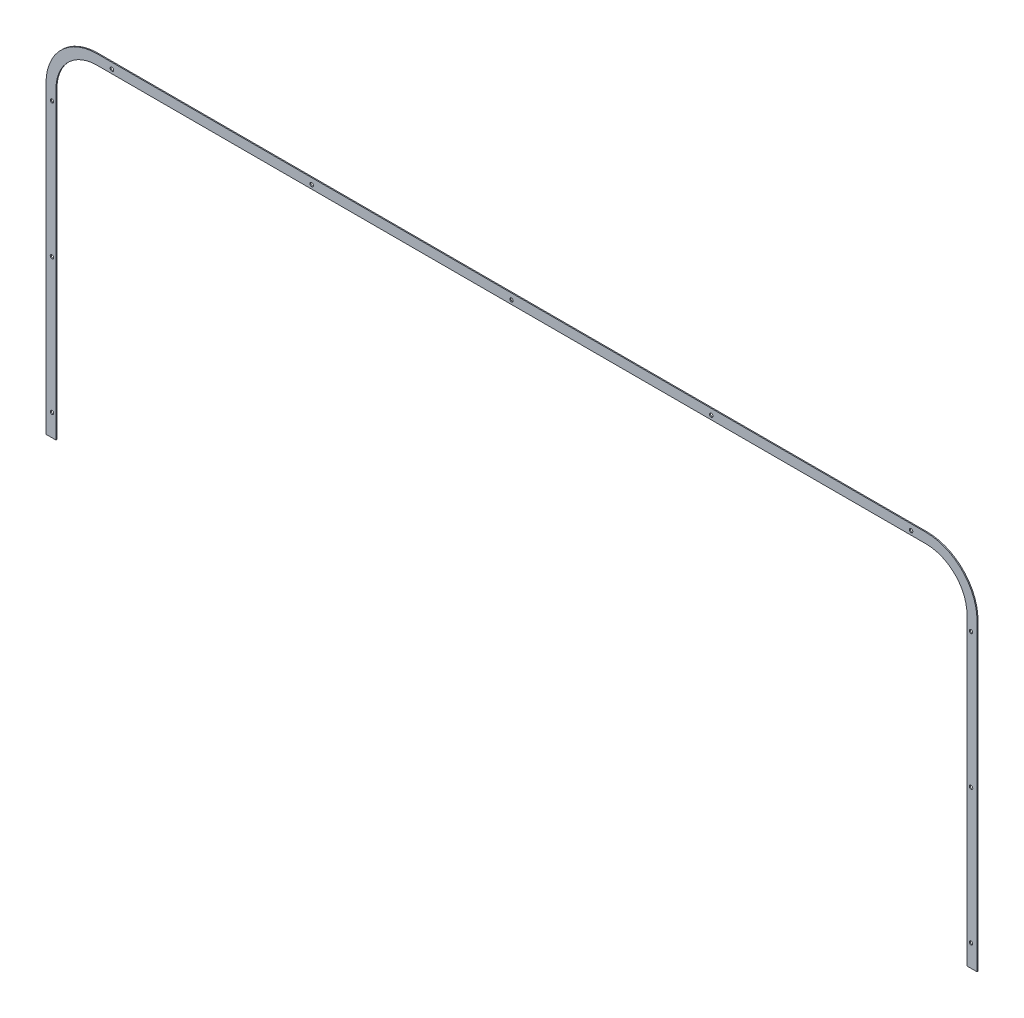
ISO-10303-21;
HEADER;
FILE_DESCRIPTION(('STEP AP214'),'2;1');
FILE_NAME('part.step','',(''),(''),'','','');
FILE_SCHEMA(('AUTOMOTIVE_DESIGN { 1 0 10303 214 1 1 1 1 }'));
ENDSEC;
DATA;
#1=APPLICATION_CONTEXT('core data for automotive mechanical design processes');
#2=APPLICATION_PROTOCOL_DEFINITION('international standard','automotive_design',2000,#1);
#3=PRODUCT_CONTEXT('',#1,'mechanical');
#4=PRODUCT('Part','Part','',(#3));
#5=PRODUCT_RELATED_PRODUCT_CATEGORY('part','',(#4));
#6=PRODUCT_DEFINITION_FORMATION('','',#4);
#7=PRODUCT_DEFINITION_CONTEXT('part definition',#1,'design');
#8=PRODUCT_DEFINITION('design','',#6,#7);
#9=PRODUCT_DEFINITION_SHAPE('','',#8);
#10=(LENGTH_UNIT() NAMED_UNIT(*) SI_UNIT(.MILLI.,.METRE.));
#11=(NAMED_UNIT(*) PLANE_ANGLE_UNIT() SI_UNIT($,.RADIAN.));
#12=(NAMED_UNIT(*) SI_UNIT($,.STERADIAN.) SOLID_ANGLE_UNIT());
#13=UNCERTAINTY_MEASURE_WITH_UNIT(LENGTH_MEASURE(1.E-05),#10,'distance_accuracy_value','');
#14=(GEOMETRIC_REPRESENTATION_CONTEXT(3) GLOBAL_UNCERTAINTY_ASSIGNED_CONTEXT((#13)) GLOBAL_UNIT_ASSIGNED_CONTEXT((#10,
#11,#12)) REPRESENTATION_CONTEXT('',''));
#15=CARTESIAN_POINT('',(0.,0.,0.));
#16=DIRECTION('',(0.,0.,1.));
#17=DIRECTION('',(1.,0.,0.));
#18=AXIS2_PLACEMENT_3D('',#15,#16,#17);
#19=CARTESIAN_POINT('',(932.,579.999999999999,-66.));
#20=DIRECTION('',(1.,0.,0.));
#21=DIRECTION('',(0.,0.,1.));
#22=AXIS2_PLACEMENT_3D('',#19,#20,#21);
#23=PLANE('',#22);
#24=DIRECTION('',(0.,-1.,0.));
#25=VECTOR('',#24,1.);
#26=CARTESIAN_POINT('',(932.,579.999999999999,-64.));
#27=LINE('',#26,#25);
#28=CARTESIAN_POINT('',(932.,579.999999999999,-64.));
#29=VERTEX_POINT('',#28);
#30=CARTESIAN_POINT('',(932.,-29.0000000000002,-64.));
#31=VERTEX_POINT('',#30);
#32=EDGE_CURVE('E153',#29,#31,#27,.T.);
#33=ORIENTED_EDGE('',*,*,#32,.T.);
#34=DIRECTION('',(0.,0.,1.));
#35=VECTOR('',#34,1.);
#36=CARTESIAN_POINT('',(932.,-29.0000000000002,-66.));
#37=LINE('',#36,#35);
#38=CARTESIAN_POINT('',(932.,-29.0000000000002,-66.));
#39=VERTEX_POINT('',#38);
#40=EDGE_CURVE('E149',#39,#31,#37,.T.);
#41=ORIENTED_EDGE('',*,*,#40,.F.);
#42=DIRECTION('',(0.,-1.,0.));
#43=VECTOR('',#42,1.);
#44=CARTESIAN_POINT('',(932.,579.999999999999,-66.));
#45=LINE('',#44,#43);
#46=CARTESIAN_POINT('',(932.,579.999999999999,-66.));
#47=VERTEX_POINT('',#46);
#48=EDGE_CURVE('E181',#47,#39,#45,.T.);
#49=ORIENTED_EDGE('',*,*,#48,.F.);
#50=DIRECTION('',(0.,0.,1.));
#51=VECTOR('',#50,1.);
#52=CARTESIAN_POINT('',(932.,579.999999999999,-66.));
#53=LINE('',#52,#51);
#54=EDGE_CURVE('E11',#47,#29,#53,.T.);
#55=ORIENTED_EDGE('',*,*,#54,.T.);
#56=EDGE_LOOP('',(#33,#41,#49,#55));
#57=FACE_BOUND('',#56,.T.);
#58=ADVANCED_FACE('F32',(#57),#23,.T.);
#59=CARTESIAN_POINT('',(830.,580.,-66.));
#60=DIRECTION('',(0.,0.,1.));
#61=DIRECTION('',(-1.,0.,0.));
#62=AXIS2_PLACEMENT_3D('',#59,#60,#61);
#63=CYLINDRICAL_SURFACE('',#62,102.);
#64=CARTESIAN_POINT('',(830.,580.,-64.));
#65=DIRECTION('',(0.,0.,-1.));
#66=DIRECTION('',(-1.,0.,0.));
#67=AXIS2_PLACEMENT_3D('',#64,#65,#66);
#68=CIRCLE('',#67,102.);
#69=CARTESIAN_POINT('',(829.999999999999,682.,-64.));
#70=VERTEX_POINT('',#69);
#71=EDGE_CURVE('E97',#70,#29,#68,.T.);
#72=ORIENTED_EDGE('',*,*,#71,.T.);
#73=ORIENTED_EDGE('',*,*,#54,.F.);
#74=CARTESIAN_POINT('',(830.,580.,-66.));
#75=DIRECTION('',(0.,0.,-1.));
#76=DIRECTION('',(-1.,0.,0.));
#77=AXIS2_PLACEMENT_3D('',#74,#75,#76);
#78=CIRCLE('',#77,102.);
#79=CARTESIAN_POINT('',(829.999999999999,682.,-66.));
#80=VERTEX_POINT('',#79);
#81=EDGE_CURVE('E50',#80,#47,#78,.T.);
#82=ORIENTED_EDGE('',*,*,#81,.F.);
#83=DIRECTION('',(0.,0.,1.));
#84=VECTOR('',#83,1.);
#85=CARTESIAN_POINT('',(829.999999999999,682.,-66.));
#86=LINE('',#85,#84);
#87=EDGE_CURVE('E41',#80,#70,#86,.T.);
#88=ORIENTED_EDGE('',*,*,#87,.T.);
#89=EDGE_LOOP('',(#72,#73,#82,#88));
#90=FACE_BOUND('',#89,.T.);
#91=ADVANCED_FACE('F308',(#90),#63,.T.);
#92=CARTESIAN_POINT('',(-829.999999999999,682.,-66.));
#93=DIRECTION('',(0.,1.,0.));
#94=DIRECTION('',(0.,0.,-1.));
#95=AXIS2_PLACEMENT_3D('',#92,#93,#94);
#96=PLANE('',#95);
#97=DIRECTION('',(1.,0.,0.));
#98=VECTOR('',#97,1.);
#99=CARTESIAN_POINT('',(-829.999999999999,682.,-64.));
#100=LINE('',#99,#98);
#101=CARTESIAN_POINT('',(-829.999999999999,682.,-64.));
#102=VERTEX_POINT('',#101);
#103=EDGE_CURVE('E91',#102,#70,#100,.T.);
#104=ORIENTED_EDGE('',*,*,#103,.T.);
#105=ORIENTED_EDGE('',*,*,#87,.F.);
#106=DIRECTION('',(1.,0.,0.));
#107=VECTOR('',#106,1.);
#108=CARTESIAN_POINT('',(-829.999999999999,682.,-66.));
#109=LINE('',#108,#107);
#110=CARTESIAN_POINT('',(-829.999999999999,682.,-66.));
#111=VERTEX_POINT('',#110);
#112=EDGE_CURVE('E134',#111,#80,#109,.T.);
#113=ORIENTED_EDGE('',*,*,#112,.F.);
#114=DIRECTION('',(0.,0.,1.));
#115=VECTOR('',#114,1.);
#116=CARTESIAN_POINT('',(-829.999999999999,682.,-66.));
#117=LINE('',#116,#115);
#118=EDGE_CURVE('E141',#111,#102,#117,.T.);
#119=ORIENTED_EDGE('',*,*,#118,.T.);
#120=EDGE_LOOP('',(#104,#105,#113,#119));
#121=FACE_BOUND('',#120,.T.);
#122=ADVANCED_FACE('F147',(#121),#96,.T.);
#123=CARTESIAN_POINT('',(-830.,580.,-66.));
#124=DIRECTION('',(0.,0.,1.));
#125=DIRECTION('',(-1.,0.,0.));
#126=AXIS2_PLACEMENT_3D('',#123,#124,#125);
#127=CYLINDRICAL_SURFACE('',#126,102.);
#128=CARTESIAN_POINT('',(-830.,580.,-64.));
#129=DIRECTION('',(0.,0.,-1.));
#130=DIRECTION('',(-1.,0.,0.));
#131=AXIS2_PLACEMENT_3D('',#128,#129,#130);
#132=CIRCLE('',#131,102.);
#133=CARTESIAN_POINT('',(-932.,579.999999999999,-64.));
#134=VERTEX_POINT('',#133);
#135=EDGE_CURVE('E144',#134,#102,#132,.T.);
#136=ORIENTED_EDGE('',*,*,#135,.T.);
#137=ORIENTED_EDGE('',*,*,#118,.F.);
#138=CARTESIAN_POINT('',(-830.,580.,-66.));
#139=DIRECTION('',(0.,0.,-1.));
#140=DIRECTION('',(-1.,0.,0.));
#141=AXIS2_PLACEMENT_3D('',#138,#139,#140);
#142=CIRCLE('',#141,102.);
#143=CARTESIAN_POINT('',(-932.,579.999999999999,-66.));
#144=VERTEX_POINT('',#143);
#145=EDGE_CURVE('E130',#144,#111,#142,.T.);
#146=ORIENTED_EDGE('',*,*,#145,.F.);
#147=DIRECTION('',(0.,0.,1.));
#148=VECTOR('',#147,1.);
#149=CARTESIAN_POINT('',(-932.,579.999999999999,-66.));
#150=LINE('',#149,#148);
#151=EDGE_CURVE('E145',#144,#134,#150,.T.);
#152=ORIENTED_EDGE('',*,*,#151,.T.);
#153=EDGE_LOOP('',(#136,#137,#146,#152));
#154=FACE_BOUND('',#153,.T.);
#155=ADVANCED_FACE('F142',(#154),#127,.T.);
#156=CARTESIAN_POINT('',(-932.,-29.0000000000002,-66.));
#157=DIRECTION('',(-1.,0.,0.));
#158=DIRECTION('',(0.,0.,-1.));
#159=AXIS2_PLACEMENT_3D('',#156,#157,#158);
#160=PLANE('',#159);
#161=DIRECTION('',(0.,1.,0.));
#162=VECTOR('',#161,1.);
#163=CARTESIAN_POINT('',(-932.,-29.0000000000002,-64.));
#164=LINE('',#163,#162);
#165=CARTESIAN_POINT('',(-932.,-29.0000000000002,-64.));
#166=VERTEX_POINT('',#165);
#167=EDGE_CURVE('E177',#166,#134,#164,.T.);
#168=ORIENTED_EDGE('',*,*,#167,.T.);
#169=ORIENTED_EDGE('',*,*,#151,.F.);
#170=DIRECTION('',(0.,1.,0.));
#171=VECTOR('',#170,1.);
#172=CARTESIAN_POINT('',(-932.,-29.0000000000002,-66.));
#173=LINE('',#172,#171);
#174=CARTESIAN_POINT('',(-932.,-29.0000000000002,-66.));
#175=VERTEX_POINT('',#174);
#176=EDGE_CURVE('E136',#175,#144,#173,.T.);
#177=ORIENTED_EDGE('',*,*,#176,.F.);
#178=DIRECTION('',(0.,0.,1.));
#179=VECTOR('',#178,1.);
#180=CARTESIAN_POINT('',(-932.,-29.0000000000002,-66.));
#181=LINE('',#180,#179);
#182=EDGE_CURVE('E185',#175,#166,#181,.T.);
#183=ORIENTED_EDGE('',*,*,#182,.T.);
#184=EDGE_LOOP('',(#168,#169,#177,#183));
#185=FACE_BOUND('',#184,.T.);
#186=ADVANCED_FACE('F304',(#185),#160,.T.);
#187=CARTESIAN_POINT('',(-932.,-29.0000000000002,-66.));
#188=DIRECTION('',(0.,1.,0.));
#189=DIRECTION('',(0.,0.,-1.));
#190=AXIS2_PLACEMENT_3D('',#187,#188,#189);
#191=PLANE('',#190);
#192=DIRECTION('',(1.,0.,0.));
#193=VECTOR('',#192,1.);
#194=CARTESIAN_POINT('',(-932.,-29.0000000000002,-64.));
#195=LINE('',#194,#193);
#196=CARTESIAN_POINT('',(-912.,-29.0000000000002,-64.));
#197=VERTEX_POINT('',#196);
#198=EDGE_CURVE('E174',#166,#197,#195,.T.);
#199=ORIENTED_EDGE('',*,*,#198,.F.);
#200=ORIENTED_EDGE('',*,*,#182,.F.);
#201=DIRECTION('',(1.,0.,0.));
#202=VECTOR('',#201,1.);
#203=CARTESIAN_POINT('',(-932.,-29.0000000000002,-66.));
#204=LINE('',#203,#202);
#205=CARTESIAN_POINT('',(-912.,-29.0000000000002,-66.));
#206=VERTEX_POINT('',#205);
#207=EDGE_CURVE('E290',#175,#206,#204,.T.);
#208=ORIENTED_EDGE('',*,*,#207,.T.);
#209=DIRECTION('',(0.,0.,1.));
#210=VECTOR('',#209,1.);
#211=CARTESIAN_POINT('',(-912.,-29.0000000000002,-66.));
#212=LINE('',#211,#210);
#213=EDGE_CURVE('E188',#206,#197,#212,.T.);
#214=ORIENTED_EDGE('',*,*,#213,.T.);
#215=EDGE_LOOP('',(#199,#200,#208,#214));
#216=FACE_BOUND('',#215,.T.);
#217=ADVANCED_FACE('F294',(#216),#191,.F.);
#218=CARTESIAN_POINT('',(-912.,-29.0000000000002,-66.));
#219=DIRECTION('',(-1.,0.,0.));
#220=DIRECTION('',(0.,0.,-1.));
#221=AXIS2_PLACEMENT_3D('',#218,#219,#220);
#222=PLANE('',#221);
#223=DIRECTION('',(0.,1.,0.));
#224=VECTOR('',#223,1.);
#225=CARTESIAN_POINT('',(-912.,-29.0000000000002,-64.));
#226=LINE('',#225,#224);
#227=CARTESIAN_POINT('',(-912.,579.999999999999,-64.));
#228=VERTEX_POINT('',#227);
#229=EDGE_CURVE('E171',#197,#228,#226,.T.);
#230=ORIENTED_EDGE('',*,*,#229,.F.);
#231=ORIENTED_EDGE('',*,*,#213,.F.);
#232=DIRECTION('',(0.,1.,0.));
#233=VECTOR('',#232,1.);
#234=CARTESIAN_POINT('',(-912.,-29.0000000000002,-66.));
#235=LINE('',#234,#233);
#236=CARTESIAN_POINT('',(-912.,579.999999999999,-66.));
#237=VERTEX_POINT('',#236);
#238=EDGE_CURVE('E287',#206,#237,#235,.T.);
#239=ORIENTED_EDGE('',*,*,#238,.T.);
#240=DIRECTION('',(0.,0.,1.));
#241=VECTOR('',#240,1.);
#242=CARTESIAN_POINT('',(-912.,579.999999999999,-66.));
#243=LINE('',#242,#241);
#244=EDGE_CURVE('E191',#237,#228,#243,.T.);
#245=ORIENTED_EDGE('',*,*,#244,.T.);
#246=EDGE_LOOP('',(#230,#231,#239,#245));
#247=FACE_BOUND('',#246,.T.);
#248=ADVANCED_FACE('F298',(#247),#222,.F.);
#249=CARTESIAN_POINT('',(-830.,580.,-66.));
#250=DIRECTION('',(0.,0.,1.));
#251=DIRECTION('',(-1.,0.,0.));
#252=AXIS2_PLACEMENT_3D('',#249,#250,#251);
#253=CYLINDRICAL_SURFACE('',#252,82.);
#254=CARTESIAN_POINT('',(-830.,580.,-64.));
#255=DIRECTION('',(0.,0.,-1.));
#256=DIRECTION('',(-1.,0.,0.));
#257=AXIS2_PLACEMENT_3D('',#254,#255,#256);
#258=CIRCLE('',#257,82.);
#259=CARTESIAN_POINT('',(-829.999999999999,662.,-64.));
#260=VERTEX_POINT('',#259);
#261=EDGE_CURVE('E168',#228,#260,#258,.T.);
#262=ORIENTED_EDGE('',*,*,#261,.F.);
#263=ORIENTED_EDGE('',*,*,#244,.F.);
#264=CARTESIAN_POINT('',(-830.,580.,-66.));
#265=DIRECTION('',(0.,0.,-1.));
#266=DIRECTION('',(-1.,0.,0.));
#267=AXIS2_PLACEMENT_3D('',#264,#265,#266);
#268=CIRCLE('',#267,82.);
#269=CARTESIAN_POINT('',(-829.999999999999,662.,-66.));
#270=VERTEX_POINT('',#269);
#271=EDGE_CURVE('E284',#237,#270,#268,.T.);
#272=ORIENTED_EDGE('',*,*,#271,.T.);
#273=DIRECTION('',(0.,0.,1.));
#274=VECTOR('',#273,1.);
#275=CARTESIAN_POINT('',(-829.999999999999,662.,-66.));
#276=LINE('',#275,#274);
#277=EDGE_CURVE('E194',#270,#260,#276,.T.);
#278=ORIENTED_EDGE('',*,*,#277,.T.);
#279=EDGE_LOOP('',(#262,#263,#272,#278));
#280=FACE_BOUND('',#279,.T.);
#281=ADVANCED_FACE('F327',(#280),#253,.F.);
#282=CARTESIAN_POINT('',(-829.999999999999,662.,-66.));
#283=DIRECTION('',(0.,1.,0.));
#284=DIRECTION('',(0.,0.,-1.));
#285=AXIS2_PLACEMENT_3D('',#282,#283,#284);
#286=PLANE('',#285);
#287=DIRECTION('',(-1.,0.,0.));
#288=VECTOR('',#287,1.);
#289=CARTESIAN_POINT('',(-829.999999999999,662.,-64.));
#290=LINE('',#289,#288);
#291=CARTESIAN_POINT('',(829.999999999999,662.,-64.));
#292=VERTEX_POINT('',#291);
#293=EDGE_CURVE('E165',#260,#292,#290,.F.);
#294=ORIENTED_EDGE('',*,*,#293,.F.);
#295=ORIENTED_EDGE('',*,*,#277,.F.);
#296=DIRECTION('',(-1.,0.,0.));
#297=VECTOR('',#296,1.);
#298=CARTESIAN_POINT('',(-829.999999999999,662.,-66.));
#299=LINE('',#298,#297);
#300=CARTESIAN_POINT('',(829.999999999999,662.,-66.));
#301=VERTEX_POINT('',#300);
#302=EDGE_CURVE('E281',#270,#301,#299,.F.);
#303=ORIENTED_EDGE('',*,*,#302,.T.);
#304=DIRECTION('',(0.,0.,1.));
#305=VECTOR('',#304,1.);
#306=CARTESIAN_POINT('',(829.999999999999,662.,-66.));
#307=LINE('',#306,#305);
#308=EDGE_CURVE('E197',#301,#292,#307,.T.);
#309=ORIENTED_EDGE('',*,*,#308,.T.);
#310=EDGE_LOOP('',(#294,#295,#303,#309));
#311=FACE_BOUND('',#310,.T.);
#312=ADVANCED_FACE('F330',(#311),#286,.F.);
#313=CARTESIAN_POINT('',(830.,580.,-66.));
#314=DIRECTION('',(0.,0.,1.));
#315=DIRECTION('',(-1.,0.,0.));
#316=AXIS2_PLACEMENT_3D('',#313,#314,#315);
#317=CYLINDRICAL_SURFACE('',#316,82.);
#318=CARTESIAN_POINT('',(830.,580.,-64.));
#319=DIRECTION('',(0.,0.,-1.));
#320=DIRECTION('',(-1.,0.,0.));
#321=AXIS2_PLACEMENT_3D('',#318,#319,#320);
#322=CIRCLE('',#321,82.);
#323=CARTESIAN_POINT('',(912.,579.999999999999,-64.));
#324=VERTEX_POINT('',#323);
#325=EDGE_CURVE('E162',#292,#324,#322,.T.);
#326=ORIENTED_EDGE('',*,*,#325,.F.);
#327=ORIENTED_EDGE('',*,*,#308,.F.);
#328=CARTESIAN_POINT('',(830.,580.,-66.));
#329=DIRECTION('',(0.,0.,-1.));
#330=DIRECTION('',(-1.,0.,0.));
#331=AXIS2_PLACEMENT_3D('',#328,#329,#330);
#332=CIRCLE('',#331,82.);
#333=CARTESIAN_POINT('',(912.,579.999999999999,-66.));
#334=VERTEX_POINT('',#333);
#335=EDGE_CURVE('E278',#301,#334,#332,.T.);
#336=ORIENTED_EDGE('',*,*,#335,.T.);
#337=DIRECTION('',(0.,0.,1.));
#338=VECTOR('',#337,1.);
#339=CARTESIAN_POINT('',(912.,579.999999999999,-66.));
#340=LINE('',#339,#338);
#341=EDGE_CURVE('E200',#334,#324,#340,.T.);
#342=ORIENTED_EDGE('',*,*,#341,.T.);
#343=EDGE_LOOP('',(#326,#327,#336,#342));
#344=FACE_BOUND('',#343,.T.);
#345=ADVANCED_FACE('F334',(#344),#317,.F.);
#346=CARTESIAN_POINT('',(912.,579.999999999999,-66.));
#347=DIRECTION('',(1.,0.,0.));
#348=DIRECTION('',(0.,0.,1.));
#349=AXIS2_PLACEMENT_3D('',#346,#347,#348);
#350=PLANE('',#349);
#351=DIRECTION('',(0.,1.,0.));
#352=VECTOR('',#351,1.);
#353=CARTESIAN_POINT('',(912.,579.999999999999,-64.));
#354=LINE('',#353,#352);
#355=CARTESIAN_POINT('',(912.,-29.0000000000002,-64.));
#356=VERTEX_POINT('',#355);
#357=EDGE_CURVE('E159',#324,#356,#354,.F.);
#358=ORIENTED_EDGE('',*,*,#357,.F.);
#359=ORIENTED_EDGE('',*,*,#341,.F.);
#360=DIRECTION('',(0.,1.,0.));
#361=VECTOR('',#360,1.);
#362=CARTESIAN_POINT('',(912.,579.999999999999,-66.));
#363=LINE('',#362,#361);
#364=CARTESIAN_POINT('',(912.,-29.0000000000002,-66.));
#365=VERTEX_POINT('',#364);
#366=EDGE_CURVE('E275',#334,#365,#363,.F.);
#367=ORIENTED_EDGE('',*,*,#366,.T.);
#368=DIRECTION('',(0.,0.,1.));
#369=VECTOR('',#368,1.);
#370=CARTESIAN_POINT('',(912.,-29.0000000000002,-66.));
#371=LINE('',#370,#369);
#372=EDGE_CURVE('E203',#365,#356,#371,.T.);
#373=ORIENTED_EDGE('',*,*,#372,.T.);
#374=EDGE_LOOP('',(#358,#359,#367,#373));
#375=FACE_BOUND('',#374,.T.);
#376=ADVANCED_FACE('F338',(#375),#350,.F.);
#377=CARTESIAN_POINT('',(912.,-29.0000000000002,-66.));
#378=DIRECTION('',(0.,1.,0.));
#379=DIRECTION('',(0.,0.,-1.));
#380=AXIS2_PLACEMENT_3D('',#377,#378,#379);
#381=PLANE('',#380);
#382=DIRECTION('',(1.,0.,0.));
#383=VECTOR('',#382,1.);
#384=CARTESIAN_POINT('',(912.,-29.0000000000002,-64.));
#385=LINE('',#384,#383);
#386=EDGE_CURVE('E156',#356,#31,#385,.T.);
#387=ORIENTED_EDGE('',*,*,#386,.F.);
#388=ORIENTED_EDGE('',*,*,#372,.F.);
#389=DIRECTION('',(1.,0.,0.));
#390=VECTOR('',#389,1.);
#391=CARTESIAN_POINT('',(912.,-29.0000000000002,-66.));
#392=LINE('',#391,#390);
#393=EDGE_CURVE('E105',#365,#39,#392,.T.);
#394=ORIENTED_EDGE('',*,*,#393,.T.);
#395=ORIENTED_EDGE('',*,*,#40,.T.);
#396=EDGE_LOOP('',(#387,#388,#394,#395));
#397=FACE_BOUND('',#396,.T.);
#398=ADVANCED_FACE('F341',(#397),#381,.F.);
#399=CARTESIAN_POINT('',(830.,580.,-66.));
#400=DIRECTION('',(0.,0.,1.));
#401=DIRECTION('',(-1.,0.,0.));
#402=AXIS2_PLACEMENT_3D('',#399,#400,#401);
#403=PLANE('',#402);
#404=CARTESIAN_POINT('',(-920.,15.,-66.));
#405=DIRECTION('',(0.,0.,1.));
#406=DIRECTION('',(1.,0.,0.));
#407=AXIS2_PLACEMENT_3D('',#404,#405,#406);
#408=CIRCLE('',#407,3.49999999999984);
#409=CARTESIAN_POINT('',(-916.5,15.,-66.));
#410=VERTEX_POINT('',#409);
#411=EDGE_CURVE('E244',#410,#410,#408,.T.);
#412=ORIENTED_EDGE('',*,*,#411,.T.);
#413=EDGE_LOOP('',(#412));
#414=FACE_BOUND('',#413,.T.);
#415=CARTESIAN_POINT('',(-920.,285.,-66.));
#416=DIRECTION('',(0.,0.,1.));
#417=DIRECTION('',(1.,0.,0.));
#418=AXIS2_PLACEMENT_3D('',#415,#416,#417);
#419=CIRCLE('',#418,3.49999999999984);
#420=CARTESIAN_POINT('',(-916.5,285.,-66.));
#421=VERTEX_POINT('',#420);
#422=EDGE_CURVE('E241',#421,#421,#419,.T.);
#423=ORIENTED_EDGE('',*,*,#422,.T.);
#424=EDGE_LOOP('',(#423));
#425=FACE_BOUND('',#424,.T.);
#426=CARTESIAN_POINT('',(-920.,555.,-66.));
#427=DIRECTION('',(0.,0.,1.));
#428=DIRECTION('',(1.,0.,0.));
#429=AXIS2_PLACEMENT_3D('',#426,#427,#428);
#430=CIRCLE('',#429,3.49999999999984);
#431=CARTESIAN_POINT('',(-916.5,555.,-66.));
#432=VERTEX_POINT('',#431);
#433=EDGE_CURVE('E238',#432,#432,#430,.T.);
#434=ORIENTED_EDGE('',*,*,#433,.T.);
#435=EDGE_LOOP('',(#434));
#436=FACE_BOUND('',#435,.T.);
#437=CARTESIAN_POINT('',(-800.,670.,-66.));
#438=DIRECTION('',(0.,0.,1.));
#439=DIRECTION('',(1.,0.,0.));
#440=AXIS2_PLACEMENT_3D('',#437,#438,#439);
#441=CIRCLE('',#440,3.49999999999984);
#442=CARTESIAN_POINT('',(-796.5,670.,-66.));
#443=VERTEX_POINT('',#442);
#444=EDGE_CURVE('E234',#443,#443,#441,.T.);
#445=ORIENTED_EDGE('',*,*,#444,.T.);
#446=EDGE_LOOP('',(#445));
#447=FACE_BOUND('',#446,.T.);
#448=CARTESIAN_POINT('',(-400.,670.,-66.));
#449=DIRECTION('',(0.,0.,1.));
#450=DIRECTION('',(1.,0.,0.));
#451=AXIS2_PLACEMENT_3D('',#448,#449,#450);
#452=CIRCLE('',#451,3.49999999999986);
#453=CARTESIAN_POINT('',(-396.5,670.,-66.));
#454=VERTEX_POINT('',#453);
#455=EDGE_CURVE('E230',#454,#454,#452,.T.);
#456=ORIENTED_EDGE('',*,*,#455,.T.);
#457=EDGE_LOOP('',(#456));
#458=FACE_BOUND('',#457,.T.);
#459=CARTESIAN_POINT('',(0.,670.,-66.));
#460=DIRECTION('',(0.,0.,1.));
#461=DIRECTION('',(1.,0.,0.));
#462=AXIS2_PLACEMENT_3D('',#459,#460,#461);
#463=CIRCLE('',#462,3.49999999999986);
#464=CARTESIAN_POINT('',(3.49999999999986,670.,-66.));
#465=VERTEX_POINT('',#464);
#466=EDGE_CURVE('E226',#465,#465,#463,.T.);
#467=ORIENTED_EDGE('',*,*,#466,.T.);
#468=EDGE_LOOP('',(#467));
#469=FACE_BOUND('',#468,.T.);
#470=CARTESIAN_POINT('',(400.,670.,-66.));
#471=DIRECTION('',(0.,0.,1.));
#472=DIRECTION('',(1.,0.,0.));
#473=AXIS2_PLACEMENT_3D('',#470,#471,#472);
#474=CIRCLE('',#473,3.49999999999986);
#475=CARTESIAN_POINT('',(403.5,670.,-66.));
#476=VERTEX_POINT('',#475);
#477=EDGE_CURVE('E222',#476,#476,#474,.T.);
#478=ORIENTED_EDGE('',*,*,#477,.T.);
#479=EDGE_LOOP('',(#478));
#480=FACE_BOUND('',#479,.T.);
#481=CARTESIAN_POINT('',(800.,670.,-66.));
#482=DIRECTION('',(0.,0.,1.));
#483=DIRECTION('',(1.,0.,0.));
#484=AXIS2_PLACEMENT_3D('',#481,#482,#483);
#485=CIRCLE('',#484,3.49999999999984);
#486=CARTESIAN_POINT('',(803.5,670.,-66.));
#487=VERTEX_POINT('',#486);
#488=EDGE_CURVE('E218',#487,#487,#485,.T.);
#489=ORIENTED_EDGE('',*,*,#488,.T.);
#490=EDGE_LOOP('',(#489));
#491=FACE_BOUND('',#490,.T.);
#492=CARTESIAN_POINT('',(920.,555.,-66.));
#493=DIRECTION('',(0.,0.,1.));
#494=DIRECTION('',(1.,0.,0.));
#495=AXIS2_PLACEMENT_3D('',#492,#493,#494);
#496=CIRCLE('',#495,3.49999999999984);
#497=CARTESIAN_POINT('',(923.5,555.,-66.));
#498=VERTEX_POINT('',#497);
#499=EDGE_CURVE('E214',#498,#498,#496,.T.);
#500=ORIENTED_EDGE('',*,*,#499,.T.);
#501=EDGE_LOOP('',(#500));
#502=FACE_BOUND('',#501,.T.);
#503=CARTESIAN_POINT('',(920.,285.,-66.));
#504=DIRECTION('',(0.,0.,1.));
#505=DIRECTION('',(1.,0.,0.));
#506=AXIS2_PLACEMENT_3D('',#503,#504,#505);
#507=CIRCLE('',#506,3.49999999999984);
#508=CARTESIAN_POINT('',(923.5,285.,-66.));
#509=VERTEX_POINT('',#508);
#510=EDGE_CURVE('E210',#509,#509,#507,.T.);
#511=ORIENTED_EDGE('',*,*,#510,.T.);
#512=EDGE_LOOP('',(#511));
#513=FACE_BOUND('',#512,.T.);
#514=CARTESIAN_POINT('',(920.,14.9999999999998,-66.));
#515=DIRECTION('',(0.,0.,1.));
#516=DIRECTION('',(1.,0.,0.));
#517=AXIS2_PLACEMENT_3D('',#514,#515,#516);
#518=CIRCLE('',#517,3.49999999999984);
#519=CARTESIAN_POINT('',(923.5,14.9999999999998,-66.));
#520=VERTEX_POINT('',#519);
#521=EDGE_CURVE('E157',#520,#520,#518,.T.);
#522=ORIENTED_EDGE('',*,*,#521,.T.);
#523=EDGE_LOOP('',(#522));
#524=FACE_BOUND('',#523,.T.);
#525=ORIENTED_EDGE('',*,*,#48,.T.);
#526=ORIENTED_EDGE('',*,*,#393,.F.);
#527=ORIENTED_EDGE('',*,*,#366,.F.);
#528=ORIENTED_EDGE('',*,*,#335,.F.);
#529=ORIENTED_EDGE('',*,*,#302,.F.);
#530=ORIENTED_EDGE('',*,*,#271,.F.);
#531=ORIENTED_EDGE('',*,*,#238,.F.);
#532=ORIENTED_EDGE('',*,*,#207,.F.);
#533=ORIENTED_EDGE('',*,*,#176,.T.);
#534=ORIENTED_EDGE('',*,*,#145,.T.);
#535=ORIENTED_EDGE('',*,*,#112,.T.);
#536=ORIENTED_EDGE('',*,*,#81,.T.);
#537=EDGE_LOOP('',(#525,#526,#527,#528,#529,#530,#531,#532,#533,#534,#535,#536));
#538=FACE_BOUND('',#537,.T.);
#539=ADVANCED_FACE('F132',(#414,#425,#436,#447,#458,#469,#480,#491,#502,#513,#524,#538),#403,.F.);
#540=CARTESIAN_POINT('',(830.,580.,-64.));
#541=DIRECTION('',(0.,0.,1.));
#542=DIRECTION('',(-1.,0.,0.));
#543=AXIS2_PLACEMENT_3D('',#540,#541,#542);
#544=PLANE('',#543);
#545=CARTESIAN_POINT('',(-920.,15.,-64.));
#546=DIRECTION('',(0.,0.,1.));
#547=DIRECTION('',(1.,0.,0.));
#548=AXIS2_PLACEMENT_3D('',#545,#546,#547);
#549=CIRCLE('',#548,3.49999999999984);
#550=CARTESIAN_POINT('',(-916.5,15.,-64.));
#551=VERTEX_POINT('',#550);
#552=EDGE_CURVE('E35',#551,#551,#549,.T.);
#553=ORIENTED_EDGE('',*,*,#552,.F.);
#554=EDGE_LOOP('',(#553));
#555=FACE_BOUND('',#554,.T.);
#556=CARTESIAN_POINT('',(-920.,285.,-64.));
#557=DIRECTION('',(0.,0.,1.));
#558=DIRECTION('',(1.,0.,0.));
#559=AXIS2_PLACEMENT_3D('',#556,#557,#558);
#560=CIRCLE('',#559,3.49999999999984);
#561=CARTESIAN_POINT('',(-916.5,285.,-64.));
#562=VERTEX_POINT('',#561);
#563=EDGE_CURVE('E242',#562,#562,#560,.T.);
#564=ORIENTED_EDGE('',*,*,#563,.F.);
#565=EDGE_LOOP('',(#564));
#566=FACE_BOUND('',#565,.T.);
#567=CARTESIAN_POINT('',(-920.,555.,-64.));
#568=DIRECTION('',(0.,0.,1.));
#569=DIRECTION('',(1.,0.,0.));
#570=AXIS2_PLACEMENT_3D('',#567,#568,#569);
#571=CIRCLE('',#570,3.49999999999984);
#572=CARTESIAN_POINT('',(-916.5,555.,-64.));
#573=VERTEX_POINT('',#572);
#574=EDGE_CURVE('E239',#573,#573,#571,.T.);
#575=ORIENTED_EDGE('',*,*,#574,.F.);
#576=EDGE_LOOP('',(#575));
#577=FACE_BOUND('',#576,.T.);
#578=CARTESIAN_POINT('',(-800.,670.,-64.));
#579=DIRECTION('',(0.,0.,1.));
#580=DIRECTION('',(1.,0.,0.));
#581=AXIS2_PLACEMENT_3D('',#578,#579,#580);
#582=CIRCLE('',#581,3.49999999999984);
#583=CARTESIAN_POINT('',(-796.5,670.,-64.));
#584=VERTEX_POINT('',#583);
#585=EDGE_CURVE('E235',#584,#584,#582,.T.);
#586=ORIENTED_EDGE('',*,*,#585,.F.);
#587=EDGE_LOOP('',(#586));
#588=FACE_BOUND('',#587,.T.);
#589=CARTESIAN_POINT('',(-400.,670.,-64.));
#590=DIRECTION('',(0.,0.,1.));
#591=DIRECTION('',(1.,0.,0.));
#592=AXIS2_PLACEMENT_3D('',#589,#590,#591);
#593=CIRCLE('',#592,3.49999999999986);
#594=CARTESIAN_POINT('',(-396.5,670.,-64.));
#595=VERTEX_POINT('',#594);
#596=EDGE_CURVE('E231',#595,#595,#593,.T.);
#597=ORIENTED_EDGE('',*,*,#596,.F.);
#598=EDGE_LOOP('',(#597));
#599=FACE_BOUND('',#598,.T.);
#600=CARTESIAN_POINT('',(0.,670.,-64.));
#601=DIRECTION('',(0.,0.,1.));
#602=DIRECTION('',(1.,0.,0.));
#603=AXIS2_PLACEMENT_3D('',#600,#601,#602);
#604=CIRCLE('',#603,3.49999999999986);
#605=CARTESIAN_POINT('',(3.49999999999986,670.,-64.));
#606=VERTEX_POINT('',#605);
#607=EDGE_CURVE('E227',#606,#606,#604,.T.);
#608=ORIENTED_EDGE('',*,*,#607,.F.);
#609=EDGE_LOOP('',(#608));
#610=FACE_BOUND('',#609,.T.);
#611=CARTESIAN_POINT('',(400.,670.,-64.));
#612=DIRECTION('',(0.,0.,1.));
#613=DIRECTION('',(1.,0.,0.));
#614=AXIS2_PLACEMENT_3D('',#611,#612,#613);
#615=CIRCLE('',#614,3.49999999999986);
#616=CARTESIAN_POINT('',(403.5,670.,-64.));
#617=VERTEX_POINT('',#616);
#618=EDGE_CURVE('E223',#617,#617,#615,.T.);
#619=ORIENTED_EDGE('',*,*,#618,.F.);
#620=EDGE_LOOP('',(#619));
#621=FACE_BOUND('',#620,.T.);
#622=CARTESIAN_POINT('',(800.,670.,-64.));
#623=DIRECTION('',(0.,0.,1.));
#624=DIRECTION('',(1.,0.,0.));
#625=AXIS2_PLACEMENT_3D('',#622,#623,#624);
#626=CIRCLE('',#625,3.49999999999984);
#627=CARTESIAN_POINT('',(803.5,670.,-64.));
#628=VERTEX_POINT('',#627);
#629=EDGE_CURVE('E219',#628,#628,#626,.T.);
#630=ORIENTED_EDGE('',*,*,#629,.F.);
#631=EDGE_LOOP('',(#630));
#632=FACE_BOUND('',#631,.T.);
#633=CARTESIAN_POINT('',(920.,555.,-64.));
#634=DIRECTION('',(0.,0.,1.));
#635=DIRECTION('',(1.,0.,0.));
#636=AXIS2_PLACEMENT_3D('',#633,#634,#635);
#637=CIRCLE('',#636,3.49999999999984);
#638=CARTESIAN_POINT('',(923.5,555.,-64.));
#639=VERTEX_POINT('',#638);
#640=EDGE_CURVE('E215',#639,#639,#637,.T.);
#641=ORIENTED_EDGE('',*,*,#640,.F.);
#642=EDGE_LOOP('',(#641));
#643=FACE_BOUND('',#642,.T.);
#644=CARTESIAN_POINT('',(920.,285.,-64.));
#645=DIRECTION('',(0.,0.,1.));
#646=DIRECTION('',(1.,0.,0.));
#647=AXIS2_PLACEMENT_3D('',#644,#645,#646);
#648=CIRCLE('',#647,3.49999999999984);
#649=CARTESIAN_POINT('',(923.5,285.,-64.));
#650=VERTEX_POINT('',#649);
#651=EDGE_CURVE('E211',#650,#650,#648,.T.);
#652=ORIENTED_EDGE('',*,*,#651,.F.);
#653=EDGE_LOOP('',(#652));
#654=FACE_BOUND('',#653,.T.);
#655=CARTESIAN_POINT('',(920.,14.9999999999998,-64.));
#656=DIRECTION('',(0.,0.,1.));
#657=DIRECTION('',(1.,0.,0.));
#658=AXIS2_PLACEMENT_3D('',#655,#656,#657);
#659=CIRCLE('',#658,3.49999999999984);
#660=CARTESIAN_POINT('',(923.5,14.9999999999998,-64.));
#661=VERTEX_POINT('',#660);
#662=EDGE_CURVE('E207',#661,#661,#659,.T.);
#663=ORIENTED_EDGE('',*,*,#662,.F.);
#664=EDGE_LOOP('',(#663));
#665=FACE_BOUND('',#664,.T.);
#666=ORIENTED_EDGE('',*,*,#32,.F.);
#667=ORIENTED_EDGE('',*,*,#71,.F.);
#668=ORIENTED_EDGE('',*,*,#103,.F.);
#669=ORIENTED_EDGE('',*,*,#135,.F.);
#670=ORIENTED_EDGE('',*,*,#167,.F.);
#671=ORIENTED_EDGE('',*,*,#198,.T.);
#672=ORIENTED_EDGE('',*,*,#229,.T.);
#673=ORIENTED_EDGE('',*,*,#261,.T.);
#674=ORIENTED_EDGE('',*,*,#293,.T.);
#675=ORIENTED_EDGE('',*,*,#325,.T.);
#676=ORIENTED_EDGE('',*,*,#357,.T.);
#677=ORIENTED_EDGE('',*,*,#386,.T.);
#678=EDGE_LOOP('',(#666,#667,#668,#669,#670,#671,#672,#673,#674,#675,#676,#677));
#679=FACE_BOUND('',#678,.T.);
#680=ADVANCED_FACE('F301',(#555,#566,#577,#588,#599,#610,#621,#632,#643,#654,#665,#679),#544,.T.);
#681=CARTESIAN_POINT('',(920.,14.9999999999998,-78.));
#682=DIRECTION('',(0.,0.,-1.));
#683=DIRECTION('',(-1.,0.,0.));
#684=AXIS2_PLACEMENT_3D('',#681,#682,#683);
#685=CYLINDRICAL_SURFACE('',#684,3.49999999999984);
#686=ORIENTED_EDGE('',*,*,#662,.T.);
#687=EDGE_LOOP('',(#686));
#688=FACE_BOUND('',#687,.T.);
#689=ORIENTED_EDGE('',*,*,#521,.F.);
#690=EDGE_LOOP('',(#689));
#691=FACE_BOUND('',#690,.T.);
#692=ADVANCED_FACE('F353',(#688,#691),#685,.F.);
#693=CARTESIAN_POINT('',(920.,285.,-78.));
#694=DIRECTION('',(0.,0.,-1.));
#695=DIRECTION('',(-1.,0.,0.));
#696=AXIS2_PLACEMENT_3D('',#693,#694,#695);
#697=CYLINDRICAL_SURFACE('',#696,3.49999999999984);
#698=ORIENTED_EDGE('',*,*,#651,.T.);
#699=EDGE_LOOP('',(#698));
#700=FACE_BOUND('',#699,.T.);
#701=ORIENTED_EDGE('',*,*,#510,.F.);
#702=EDGE_LOOP('',(#701));
#703=FACE_BOUND('',#702,.T.);
#704=ADVANCED_FACE('F359',(#700,#703),#697,.F.);
#705=CARTESIAN_POINT('',(920.,555.,-78.));
#706=DIRECTION('',(0.,0.,-1.));
#707=DIRECTION('',(-1.,0.,0.));
#708=AXIS2_PLACEMENT_3D('',#705,#706,#707);
#709=CYLINDRICAL_SURFACE('',#708,3.49999999999984);
#710=ORIENTED_EDGE('',*,*,#640,.T.);
#711=EDGE_LOOP('',(#710));
#712=FACE_BOUND('',#711,.T.);
#713=ORIENTED_EDGE('',*,*,#499,.F.);
#714=EDGE_LOOP('',(#713));
#715=FACE_BOUND('',#714,.T.);
#716=ADVANCED_FACE('F363',(#712,#715),#709,.F.);
#717=CARTESIAN_POINT('',(800.,670.,-78.));
#718=DIRECTION('',(0.,0.,-1.));
#719=DIRECTION('',(-1.,0.,0.));
#720=AXIS2_PLACEMENT_3D('',#717,#718,#719);
#721=CYLINDRICAL_SURFACE('',#720,3.49999999999984);
#722=ORIENTED_EDGE('',*,*,#629,.T.);
#723=EDGE_LOOP('',(#722));
#724=FACE_BOUND('',#723,.T.);
#725=ORIENTED_EDGE('',*,*,#488,.F.);
#726=EDGE_LOOP('',(#725));
#727=FACE_BOUND('',#726,.T.);
#728=ADVANCED_FACE('F367',(#724,#727),#721,.F.);
#729=CARTESIAN_POINT('',(400.,670.,-78.));
#730=DIRECTION('',(0.,0.,-1.));
#731=DIRECTION('',(-1.,0.,0.));
#732=AXIS2_PLACEMENT_3D('',#729,#730,#731);
#733=CYLINDRICAL_SURFACE('',#732,3.49999999999986);
#734=ORIENTED_EDGE('',*,*,#618,.T.);
#735=EDGE_LOOP('',(#734));
#736=FACE_BOUND('',#735,.T.);
#737=ORIENTED_EDGE('',*,*,#477,.F.);
#738=EDGE_LOOP('',(#737));
#739=FACE_BOUND('',#738,.T.);
#740=ADVANCED_FACE('F371',(#736,#739),#733,.F.);
#741=CARTESIAN_POINT('',(0.,670.,-78.));
#742=DIRECTION('',(0.,0.,-1.));
#743=DIRECTION('',(-1.,0.,0.));
#744=AXIS2_PLACEMENT_3D('',#741,#742,#743);
#745=CYLINDRICAL_SURFACE('',#744,3.49999999999986);
#746=ORIENTED_EDGE('',*,*,#607,.T.);
#747=EDGE_LOOP('',(#746));
#748=FACE_BOUND('',#747,.T.);
#749=ORIENTED_EDGE('',*,*,#466,.F.);
#750=EDGE_LOOP('',(#749));
#751=FACE_BOUND('',#750,.T.);
#752=ADVANCED_FACE('F375',(#748,#751),#745,.F.);
#753=CARTESIAN_POINT('',(-400.,670.,-78.));
#754=DIRECTION('',(0.,0.,-1.));
#755=DIRECTION('',(-1.,0.,0.));
#756=AXIS2_PLACEMENT_3D('',#753,#754,#755);
#757=CYLINDRICAL_SURFACE('',#756,3.49999999999986);
#758=ORIENTED_EDGE('',*,*,#596,.T.);
#759=EDGE_LOOP('',(#758));
#760=FACE_BOUND('',#759,.T.);
#761=ORIENTED_EDGE('',*,*,#455,.F.);
#762=EDGE_LOOP('',(#761));
#763=FACE_BOUND('',#762,.T.);
#764=ADVANCED_FACE('F379',(#760,#763),#757,.F.);
#765=CARTESIAN_POINT('',(-800.,670.,-78.));
#766=DIRECTION('',(0.,0.,-1.));
#767=DIRECTION('',(-1.,0.,0.));
#768=AXIS2_PLACEMENT_3D('',#765,#766,#767);
#769=CYLINDRICAL_SURFACE('',#768,3.49999999999984);
#770=ORIENTED_EDGE('',*,*,#585,.T.);
#771=EDGE_LOOP('',(#770));
#772=FACE_BOUND('',#771,.T.);
#773=ORIENTED_EDGE('',*,*,#444,.F.);
#774=EDGE_LOOP('',(#773));
#775=FACE_BOUND('',#774,.T.);
#776=ADVANCED_FACE('F383',(#772,#775),#769,.F.);
#777=CARTESIAN_POINT('',(-920.,555.,-78.));
#778=DIRECTION('',(0.,0.,-1.));
#779=DIRECTION('',(-1.,0.,0.));
#780=AXIS2_PLACEMENT_3D('',#777,#778,#779);
#781=CYLINDRICAL_SURFACE('',#780,3.49999999999984);
#782=ORIENTED_EDGE('',*,*,#574,.T.);
#783=EDGE_LOOP('',(#782));
#784=FACE_BOUND('',#783,.T.);
#785=ORIENTED_EDGE('',*,*,#433,.F.);
#786=EDGE_LOOP('',(#785));
#787=FACE_BOUND('',#786,.T.);
#788=ADVANCED_FACE('F387',(#784,#787),#781,.F.);
#789=CARTESIAN_POINT('',(-920.,285.,-78.));
#790=DIRECTION('',(0.,0.,-1.));
#791=DIRECTION('',(-1.,0.,0.));
#792=AXIS2_PLACEMENT_3D('',#789,#790,#791);
#793=CYLINDRICAL_SURFACE('',#792,3.49999999999984);
#794=ORIENTED_EDGE('',*,*,#563,.T.);
#795=EDGE_LOOP('',(#794));
#796=FACE_BOUND('',#795,.T.);
#797=ORIENTED_EDGE('',*,*,#422,.F.);
#798=EDGE_LOOP('',(#797));
#799=FACE_BOUND('',#798,.T.);
#800=ADVANCED_FACE('F391',(#796,#799),#793,.F.);
#801=CARTESIAN_POINT('',(-920.,15.,-78.));
#802=DIRECTION('',(0.,0.,-1.));
#803=DIRECTION('',(-1.,0.,0.));
#804=AXIS2_PLACEMENT_3D('',#801,#802,#803);
#805=CYLINDRICAL_SURFACE('',#804,3.49999999999984);
#806=ORIENTED_EDGE('',*,*,#552,.T.);
#807=EDGE_LOOP('',(#806));
#808=FACE_BOUND('',#807,.T.);
#809=ORIENTED_EDGE('',*,*,#411,.F.);
#810=EDGE_LOOP('',(#809));
#811=FACE_BOUND('',#810,.T.);
#812=ADVANCED_FACE('F395',(#808,#811),#805,.F.);
#813=CLOSED_SHELL('',(#58,#91,#122,#155,#186,#217,#248,#281,#312,#345,#376,#398,#539,#680,#692,
#704,#716,#728,#740,#752,#764,#776,#788,#800,#812));
#814=MANIFOLD_SOLID_BREP('B2',#813);
#815=ADVANCED_BREP_SHAPE_REPRESENTATION('',(#18,#814),#14);
#816=SHAPE_DEFINITION_REPRESENTATION(#9,#815);
ENDSEC;
END-ISO-10303-21;
